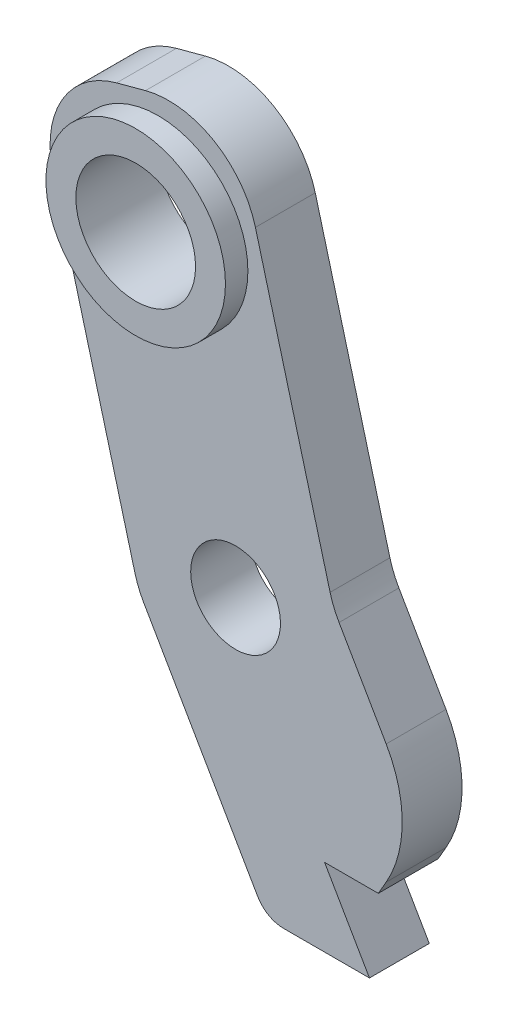
ISO-10303-21;
HEADER;
FILE_DESCRIPTION(('STEP AP214'),'2;1');
FILE_NAME('part.step','',(''),(''),'','','');
FILE_SCHEMA(('AUTOMOTIVE_DESIGN { 1 0 10303 214 1 1 1 1 }'));
ENDSEC;
DATA;
#1=APPLICATION_CONTEXT('core data for automotive mechanical design processes');
#2=APPLICATION_PROTOCOL_DEFINITION('international standard','automotive_design',2000,#1);
#3=PRODUCT_CONTEXT('',#1,'mechanical');
#4=PRODUCT('Part','Part','',(#3));
#5=PRODUCT_RELATED_PRODUCT_CATEGORY('part','',(#4));
#6=PRODUCT_DEFINITION_FORMATION('','',#4);
#7=PRODUCT_DEFINITION_CONTEXT('part definition',#1,'design');
#8=PRODUCT_DEFINITION('design','',#6,#7);
#9=PRODUCT_DEFINITION_SHAPE('','',#8);
#10=(LENGTH_UNIT() NAMED_UNIT(*) SI_UNIT(.MILLI.,.METRE.));
#11=(NAMED_UNIT(*) PLANE_ANGLE_UNIT() SI_UNIT($,.RADIAN.));
#12=(NAMED_UNIT(*) SI_UNIT($,.STERADIAN.) SOLID_ANGLE_UNIT());
#13=UNCERTAINTY_MEASURE_WITH_UNIT(LENGTH_MEASURE(1.E-05),#10,'distance_accuracy_value','');
#14=(GEOMETRIC_REPRESENTATION_CONTEXT(3) GLOBAL_UNCERTAINTY_ASSIGNED_CONTEXT((#13)) GLOBAL_UNIT_ASSIGNED_CONTEXT((#10,
#11,#12)) REPRESENTATION_CONTEXT('',''));
#15=CARTESIAN_POINT('',(0.,0.,0.));
#16=DIRECTION('',(0.,0.,1.));
#17=DIRECTION('',(1.,0.,0.));
#18=AXIS2_PLACEMENT_3D('',#15,#16,#17);
#19=CARTESIAN_POINT('',(0.,0.,37.2524640543525));
#20=DIRECTION('',(0.,0.,1.));
#21=DIRECTION('',(-1.,0.,0.));
#22=AXIS2_PLACEMENT_3D('',#19,#20,#21);
#23=PLANE('',#22);
#24=CARTESIAN_POINT('',(-16.5877555472492,18.6593747845128,37.2524640543525));
#25=DIRECTION('',(0.,0.,-1.));
#26=DIRECTION('',(-1.,0.,0.));
#27=AXIS2_PLACEMENT_3D('',#24,#25,#26);
#28=CIRCLE('',#27,3.00000000000001);
#29=CARTESIAN_POINT('',(-19.5877555472492,18.6593747845128,37.2524640543525));
#30=VERTEX_POINT('',#29);
#31=EDGE_CURVE('E11',#30,#30,#28,.T.);
#32=ORIENTED_EDGE('',*,*,#31,.T.);
#33=EDGE_LOOP('',(#32));
#34=FACE_BOUND('',#33,.T.);
#35=DIRECTION('',(0.999999998986407,-4.50242804108572E-05,0.));
#36=VECTOR('',#35,1.);
#37=CARTESIAN_POINT('',(-12.9759854417635,0.226354757444194,37.2524640543525));
#38=LINE('',#37,#36);
#39=CARTESIAN_POINT('',(-12.3986651889558,0.226328764015219,37.2524640543525));
#40=VERTEX_POINT('',#39);
#41=CARTESIAN_POINT('',(-9.52484687315475,0.226199372413387,37.2524640543525));
#42=VERTEX_POINT('',#41);
#43=EDGE_CURVE('E151',#40,#42,#38,.T.);
#44=ORIENTED_EDGE('',*,*,#43,.T.);
#45=DIRECTION('',(-0.500000000000004,0.866025403784436,0.));
#46=VECTOR('',#45,1.);
#47=CARTESIAN_POINT('',(-9.52484687315475,0.226199372413387,37.2524640543525));
#48=LINE('',#47,#46);
#49=CARTESIAN_POINT('',(-11.0248468731548,2.8242755837667,37.2524640543525));
#50=VERTEX_POINT('',#49);
#51=EDGE_CURVE('E156',#42,#50,#48,.T.);
#52=ORIENTED_EDGE('',*,*,#51,.T.);
#53=DIRECTION('',(1.,0.,0.));
#54=VECTOR('',#53,1.);
#55=CARTESIAN_POINT('',(-11.0248468731548,2.8242755837667,37.2524640543525));
#56=LINE('',#55,#54);
#57=CARTESIAN_POINT('',(-9.2296199535991,2.8242755837667,37.2524640543525));
#58=VERTEX_POINT('',#57);
#59=EDGE_CURVE('E178',#50,#58,#56,.T.);
#60=ORIENTED_EDGE('',*,*,#59,.T.);
#61=DIRECTION('',(0.500000000000004,0.866025403784436,0.));
#62=VECTOR('',#61,1.);
#63=CARTESIAN_POINT('',(-7.81130595755921,5.2808674859938,37.2524640543525));
#64=LINE('',#63,#62);
#65=CARTESIAN_POINT('',(-8.96600649593849,3.28086748599378,37.2524640543525));
#66=VERTEX_POINT('',#65);
#67=EDGE_CURVE('E186',#58,#66,#64,.T.);
#68=ORIENTED_EDGE('',*,*,#67,.T.);
#69=CARTESIAN_POINT('',(-12.4301081110762,5.2808674859938,37.2524640543525));
#70=DIRECTION('',(0.,0.,-1.));
#71=DIRECTION('',(-1.,0.,0.));
#72=AXIS2_PLACEMENT_3D('',#69,#70,#71);
#73=CIRCLE('',#72,4.);
#74=CARTESIAN_POINT('',(-8.96600649593849,7.28086748599382,37.2524640543525));
#75=VERTEX_POINT('',#74);
#76=EDGE_CURVE('E228',#75,#66,#73,.T.);
#77=ORIENTED_EDGE('',*,*,#76,.F.);
#78=DIRECTION('',(-0.500000000000005,0.866025403784436,0.));
#79=VECTOR('',#78,1.);
#80=CARTESIAN_POINT('',(-10.7384791367817,10.3508801549599,37.2524640543525));
#81=LINE('',#80,#79);
#82=CARTESIAN_POINT('',(-10.540966036805,10.0087774306399,37.2524640543525));
#83=VERTEX_POINT('',#82);
#84=EDGE_CURVE('E261',#75,#83,#81,.T.);
#85=ORIENTED_EDGE('',*,*,#84,.T.);
#86=CARTESIAN_POINT('',(-7.94288982545166,11.5087774306399,37.2524640543525));
#87=DIRECTION('',(0.,0.,-1.));
#88=DIRECTION('',(-1.,0.,0.));
#89=AXIS2_PLACEMENT_3D('',#86,#87,#88);
#90=CIRCLE('',#89,3.);
#91=CARTESIAN_POINT('',(-10.8407022608055,10.7324507664651,37.2524640543525));
#92=VERTEX_POINT('',#91);
#93=EDGE_CURVE('E221',#92,#83,#90,.F.);
#94=ORIENTED_EDGE('',*,*,#93,.F.);
#95=DIRECTION('',(-0.258775554724922,0.965937478451276,0.));
#96=VECTOR('',#95,1.);
#97=CARTESIAN_POINT('',(-10.7384791367817,10.3508801549599,37.2524640543525));
#98=LINE('',#97,#96);
#99=CARTESIAN_POINT('',(-13.3363621500322,20.0480579652756,37.2524640543525));
#100=VERTEX_POINT('',#99);
#101=EDGE_CURVE('E257',#92,#100,#98,.T.);
#102=ORIENTED_EDGE('',*,*,#101,.T.);
#103=CARTESIAN_POINT('',(-16.2341745853861,19.2717313011009,37.2524640543525));
#104=DIRECTION('',(0.,0.,-1.));
#105=DIRECTION('',(-1.,0.,0.));
#106=AXIS2_PLACEMENT_3D('',#103,#104,#105);
#107=CIRCLE('',#106,3.);
#108=CARTESIAN_POINT('',(-17.0105012495608,22.1695437364547,37.2524640543525));
#109=VERTEX_POINT('',#108);
#110=EDGE_CURVE('E199',#109,#100,#107,.T.);
#111=ORIENTED_EDGE('',*,*,#110,.F.);
#112=DIRECTION('',(-0.965937478451276,-0.258775554724923,0.));
#113=VECTOR('',#112,1.);
#114=CARTESIAN_POINT('',(-14.112688814207,22.9458704006295,37.2524640543525));
#115=LINE('',#114,#113);
#116=CARTESIAN_POINT('',(-17.9764387280121,21.9107681817298,37.2524640543525));
#117=VERTEX_POINT('',#116);
#118=EDGE_CURVE('E252',#109,#117,#115,.T.);
#119=ORIENTED_EDGE('',*,*,#118,.T.);
#120=CARTESIAN_POINT('',(-17.2001120638373,19.0129557463759,37.2524640543525));
#121=DIRECTION('',(0.,0.,-1.));
#122=DIRECTION('',(-1.,0.,0.));
#123=AXIS2_PLACEMENT_3D('',#120,#121,#122);
#124=CIRCLE('',#123,3.);
#125=CARTESIAN_POINT('',(-20.0979244991912,18.2366290822012,37.2524640543525));
#126=VERTEX_POINT('',#125);
#127=EDGE_CURVE('E196',#126,#117,#124,.T.);
#128=ORIENTED_EDGE('',*,*,#127,.F.);
#129=DIRECTION('',(0.258775554724923,-0.965937478451276,0.));
#130=VECTOR('',#129,1.);
#131=CARTESIAN_POINT('',(-20.8742511633659,21.134441517555,37.2524640543525));
#132=LINE('',#131,#130);
#133=CARTESIAN_POINT('',(-17.3637439872422,8.03069045654523,37.2524640543525));
#134=VERTEX_POINT('',#133);
#135=EDGE_CURVE('E243',#126,#134,#132,.T.);
#136=ORIENTED_EDGE('',*,*,#135,.T.);
#137=CARTESIAN_POINT('',(-14.4659315518883,8.80701712072,37.2524640543525));
#138=DIRECTION('',(0.,0.,-1.));
#139=DIRECTION('',(-1.,0.,0.));
#140=AXIS2_PLACEMENT_3D('',#137,#138,#139);
#141=CIRCLE('',#140,3.);
#142=CARTESIAN_POINT('',(-17.0640077632416,7.30701712071999,37.2524640543525));
#143=VERTEX_POINT('',#142);
#144=EDGE_CURVE('E202',#143,#134,#141,.T.);
#145=ORIENTED_EDGE('',*,*,#144,.F.);
#146=DIRECTION('',(0.500000000000005,-0.866025403784436,0.));
#147=VECTOR('',#146,1.);
#148=CARTESIAN_POINT('',(-17.2615208632183,7.64911984504006,37.2524640543525));
#149=LINE('',#148,#147);
#150=CARTESIAN_POINT('',(-13.2646455684599,0.726328763001622,37.2524640543525));
#151=VERTEX_POINT('',#150);
#152=EDGE_CURVE('E164',#143,#151,#149,.T.);
#153=ORIENTED_EDGE('',*,*,#152,.T.);
#154=CARTESIAN_POINT('',(-12.3986201646754,1.22632876300163,37.2524640543525));
#155=DIRECTION('',(0.,0.,-1.));
#156=DIRECTION('',(-1.,0.,0.));
#157=AXIS2_PLACEMENT_3D('',#154,#155,#156);
#158=CIRCLE('',#157,1.);
#159=EDGE_CURVE('E237',#40,#151,#158,.T.);
#160=ORIENTED_EDGE('',*,*,#159,.F.);
#161=EDGE_LOOP('',(#44,#52,#60,#68,#77,#85,#94,#102,#111,#119,#128,#136,#145,#153,#160));
#162=FACE_BOUND('',#161,.T.);
#163=CARTESIAN_POINT('',(-14.,9.,37.2524640543525));
#164=DIRECTION('',(0.,0.,1.));
#165=DIRECTION('',(0.,-1.,0.));
#166=AXIS2_PLACEMENT_3D('',#163,#164,#165);
#167=CIRCLE('',#166,1.5);
#168=CARTESIAN_POINT('',(-14.,7.5,37.2524640543525));
#169=VERTEX_POINT('',#168);
#170=EDGE_CURVE('E265',#169,#169,#167,.T.);
#171=ORIENTED_EDGE('',*,*,#170,.F.);
#172=EDGE_LOOP('',(#171));
#173=FACE_BOUND('',#172,.T.);
#174=ADVANCED_FACE('F35',(#34,#162,#173),#23,.T.);
#175=CARTESIAN_POINT('',(-10.7384791367817,10.3508801549599,9.04513704299428));
#176=DIRECTION('',(-0.866025403784436,-0.500000000000005,0.));
#177=DIRECTION('',(0.500000000000005,-0.866025403784436,0.));
#178=AXIS2_PLACEMENT_3D('',#175,#176,#177);
#179=PLANE('',#178);
#180=DIRECTION('',(0.500000000000005,-0.866025403784436,0.));
#181=VECTOR('',#180,1.);
#182=CARTESIAN_POINT('',(-10.7384791367817,10.3508801549599,35.2524640543526));
#183=LINE('',#182,#181);
#184=CARTESIAN_POINT('',(-10.540966036805,10.0087774306399,35.2524640543526));
#185=VERTEX_POINT('',#184);
#186=CARTESIAN_POINT('',(-8.96600649593849,7.28086748599382,35.2524640543526));
#187=VERTEX_POINT('',#186);
#188=EDGE_CURVE('E264',#185,#187,#183,.T.);
#189=ORIENTED_EDGE('',*,*,#188,.F.);
#190=DIRECTION('',(0.,0.,1.));
#191=VECTOR('',#190,1.);
#192=CARTESIAN_POINT('',(-10.540966036805,10.0087774306399,35.2524640543526));
#193=LINE('',#192,#191);
#194=EDGE_CURVE('E191',#83,#185,#193,.F.);
#195=ORIENTED_EDGE('',*,*,#194,.F.);
#196=ORIENTED_EDGE('',*,*,#84,.F.);
#197=DIRECTION('',(0.,0.,1.));
#198=VECTOR('',#197,1.);
#199=CARTESIAN_POINT('',(-8.96600649593849,7.28086748599382,9.04513704299428));
#200=LINE('',#199,#198);
#201=EDGE_CURVE('E226',#187,#75,#200,.T.);
#202=ORIENTED_EDGE('',*,*,#201,.F.);
#203=EDGE_LOOP('',(#189,#195,#196,#202));
#204=FACE_BOUND('',#203,.T.);
#205=ADVANCED_FACE('F296',(#204),#179,.F.);
#206=CARTESIAN_POINT('',(-10.7384791367817,10.3508801549599,9.04513704299428));
#207=DIRECTION('',(-0.965937478451276,-0.258775554724922,0.));
#208=DIRECTION('',(0.258775554724922,-0.965937478451276,0.));
#209=AXIS2_PLACEMENT_3D('',#206,#207,#208);
#210=PLANE('',#209);
#211=DIRECTION('',(0.258775554724922,-0.965937478451276,0.));
#212=VECTOR('',#211,1.);
#213=CARTESIAN_POINT('',(-10.7384791367817,10.3508801549599,35.2524640543526));
#214=LINE('',#213,#212);
#215=CARTESIAN_POINT('',(-13.3363621500322,20.0480579652756,35.2524640543526));
#216=VERTEX_POINT('',#215);
#217=CARTESIAN_POINT('',(-10.8407022608055,10.7324507664651,35.2524640543526));
#218=VERTEX_POINT('',#217);
#219=EDGE_CURVE('E260',#216,#218,#214,.T.);
#220=ORIENTED_EDGE('',*,*,#219,.F.);
#221=DIRECTION('',(0.,0.,1.));
#222=VECTOR('',#221,1.);
#223=CARTESIAN_POINT('',(-13.3363621500322,20.0480579652756,9.04513704299428));
#224=LINE('',#223,#222);
#225=EDGE_CURVE('E182',#100,#216,#224,.F.);
#226=ORIENTED_EDGE('',*,*,#225,.F.);
#227=ORIENTED_EDGE('',*,*,#101,.F.);
#228=DIRECTION('',(0.,0.,1.));
#229=VECTOR('',#228,1.);
#230=CARTESIAN_POINT('',(-10.8407022608055,10.7324507664651,37.2524640543525));
#231=LINE('',#230,#229);
#232=EDGE_CURVE('E189',#218,#92,#231,.T.);
#233=ORIENTED_EDGE('',*,*,#232,.F.);
#234=EDGE_LOOP('',(#220,#226,#227,#233));
#235=FACE_BOUND('',#234,.T.);
#236=ADVANCED_FACE('F288',(#235),#210,.F.);
#237=CARTESIAN_POINT('',(-14.112688814207,22.9458704006295,9.04513704299428));
#238=DIRECTION('',(0.258775554724923,-0.965937478451276,0.));
#239=DIRECTION('',(0.965937478451276,0.258775554724923,0.));
#240=AXIS2_PLACEMENT_3D('',#237,#238,#239);
#241=PLANE('',#240);
#242=DIRECTION('',(0.965937478451276,0.258775554724923,0.));
#243=VECTOR('',#242,1.);
#244=CARTESIAN_POINT('',(-14.112688814207,22.9458704006295,35.2524640543526));
#245=LINE('',#244,#243);
#246=CARTESIAN_POINT('',(-17.9764387280121,21.9107681817298,35.2524640543526));
#247=VERTEX_POINT('',#246);
#248=CARTESIAN_POINT('',(-17.0105012495608,22.1695437364547,35.2524640543526));
#249=VERTEX_POINT('',#248);
#250=EDGE_CURVE('E256',#247,#249,#245,.T.);
#251=ORIENTED_EDGE('',*,*,#250,.F.);
#252=DIRECTION('',(0.,0.,1.));
#253=VECTOR('',#252,1.);
#254=CARTESIAN_POINT('',(-17.9764387280121,21.9107681817298,9.04513704299428));
#255=LINE('',#254,#253);
#256=EDGE_CURVE('E216',#117,#247,#255,.F.);
#257=ORIENTED_EDGE('',*,*,#256,.F.);
#258=ORIENTED_EDGE('',*,*,#118,.F.);
#259=DIRECTION('',(0.,0.,1.));
#260=VECTOR('',#259,1.);
#261=CARTESIAN_POINT('',(-17.0105012495608,22.1695437364547,9.04513704299428));
#262=LINE('',#261,#260);
#263=EDGE_CURVE('E219',#249,#109,#262,.T.);
#264=ORIENTED_EDGE('',*,*,#263,.F.);
#265=EDGE_LOOP('',(#251,#257,#258,#264));
#266=FACE_BOUND('',#265,.T.);
#267=ADVANCED_FACE('F279',(#266),#241,.F.);
#268=CARTESIAN_POINT('',(-20.8742511633659,21.134441517555,9.04513704299428));
#269=DIRECTION('',(0.965937478451276,0.258775554724923,0.));
#270=DIRECTION('',(-0.258775554724923,0.965937478451276,0.));
#271=AXIS2_PLACEMENT_3D('',#268,#269,#270);
#272=PLANE('',#271);
#273=ORIENTED_EDGE('',*,*,#135,.F.);
#274=DIRECTION('',(0.,0.,1.));
#275=VECTOR('',#274,1.);
#276=CARTESIAN_POINT('',(-20.0979244991912,18.2366290822012,9.04513704299428));
#277=LINE('',#276,#275);
#278=CARTESIAN_POINT('',(-20.0979244991912,18.2366290822012,35.2524640543526));
#279=VERTEX_POINT('',#278);
#280=EDGE_CURVE('E205',#279,#126,#277,.T.);
#281=ORIENTED_EDGE('',*,*,#280,.F.);
#282=DIRECTION('',(-0.258775554724923,0.965937478451276,0.));
#283=VECTOR('',#282,1.);
#284=CARTESIAN_POINT('',(-20.8742511633659,21.134441517555,35.2524640543526));
#285=LINE('',#284,#283);
#286=CARTESIAN_POINT('',(-17.3637439872422,8.03069045654524,35.2524640543526));
#287=VERTEX_POINT('',#286);
#288=EDGE_CURVE('E245',#287,#279,#285,.T.);
#289=ORIENTED_EDGE('',*,*,#288,.F.);
#290=DIRECTION('',(0.,0.,1.));
#291=VECTOR('',#290,1.);
#292=CARTESIAN_POINT('',(-17.3637439872422,8.03069045654524,9.04513704299428));
#293=LINE('',#292,#291);
#294=EDGE_CURVE('E207',#134,#287,#293,.F.);
#295=ORIENTED_EDGE('',*,*,#294,.F.);
#296=EDGE_LOOP('',(#273,#281,#289,#295));
#297=FACE_BOUND('',#296,.T.);
#298=ADVANCED_FACE('F356',(#297),#272,.F.);
#299=CARTESIAN_POINT('',(-17.2615208632183,7.64911984504006,9.04513704299428));
#300=DIRECTION('',(0.866025403784436,0.500000000000005,0.));
#301=DIRECTION('',(-0.500000000000005,0.866025403784436,0.));
#302=AXIS2_PLACEMENT_3D('',#299,#300,#301);
#303=PLANE('',#302);
#304=ORIENTED_EDGE('',*,*,#152,.F.);
#305=DIRECTION('',(0.,0.,1.));
#306=VECTOR('',#305,1.);
#307=CARTESIAN_POINT('',(-17.0640077632416,7.30701712071999,9.04513704299428));
#308=LINE('',#307,#306);
#309=CARTESIAN_POINT('',(-17.0640077632416,7.30701712071999,35.2524640543526));
#310=VERTEX_POINT('',#309);
#311=EDGE_CURVE('E194',#310,#143,#308,.T.);
#312=ORIENTED_EDGE('',*,*,#311,.F.);
#313=DIRECTION('',(-0.500000000000005,0.866025403784436,0.));
#314=VECTOR('',#313,1.);
#315=CARTESIAN_POINT('',(-17.2615208632183,7.64911984504006,35.2524640543526));
#316=LINE('',#315,#314);
#317=CARTESIAN_POINT('',(-13.2646455684599,0.726328763001622,35.2524640543526));
#318=VERTEX_POINT('',#317);
#319=EDGE_CURVE('E168',#318,#310,#316,.T.);
#320=ORIENTED_EDGE('',*,*,#319,.F.);
#321=DIRECTION('',(0.,0.,1.));
#322=VECTOR('',#321,1.);
#323=CARTESIAN_POINT('',(-13.2646455684599,0.726328763001622,9.04513704299428));
#324=LINE('',#323,#322);
#325=EDGE_CURVE('E56',#151,#318,#324,.F.);
#326=ORIENTED_EDGE('',*,*,#325,.F.);
#327=EDGE_LOOP('',(#304,#312,#320,#326));
#328=FACE_BOUND('',#327,.T.);
#329=ADVANCED_FACE('F242',(#328),#303,.F.);
#330=CARTESIAN_POINT('',(-12.9759854417635,0.226354757444194,9.04513704299428));
#331=DIRECTION('',(4.50242804108572E-05,0.999999998986407,0.));
#332=DIRECTION('',(-0.999999998986407,4.50242804108572E-05,0.));
#333=AXIS2_PLACEMENT_3D('',#330,#331,#332);
#334=PLANE('',#333);
#335=DIRECTION('',(-0.999999998986407,4.50242804108572E-05,0.));
#336=VECTOR('',#335,1.);
#337=CARTESIAN_POINT('',(-12.9759854417635,0.226354757444194,35.2524640543526));
#338=LINE('',#337,#336);
#339=CARTESIAN_POINT('',(-9.52484687315475,0.226199372413387,35.2524640543526));
#340=VERTEX_POINT('',#339);
#341=CARTESIAN_POINT('',(-12.3986651889558,0.226328764015219,35.2524640543526));
#342=VERTEX_POINT('',#341);
#343=EDGE_CURVE('E145',#340,#342,#338,.T.);
#344=ORIENTED_EDGE('',*,*,#343,.F.);
#345=DIRECTION('',(0.,0.,1.));
#346=VECTOR('',#345,1.);
#347=CARTESIAN_POINT('',(-9.52484687315475,0.226199372413387,9.04513704299428));
#348=LINE('',#347,#346);
#349=EDGE_CURVE('E150',#340,#42,#348,.T.);
#350=ORIENTED_EDGE('',*,*,#349,.T.);
#351=ORIENTED_EDGE('',*,*,#43,.F.);
#352=DIRECTION('',(0.,0.,1.));
#353=VECTOR('',#352,1.);
#354=CARTESIAN_POINT('',(-12.3986651889558,0.226328764015219,9.04513704299428));
#355=LINE('',#354,#353);
#356=EDGE_CURVE('E163',#342,#40,#355,.T.);
#357=ORIENTED_EDGE('',*,*,#356,.F.);
#358=EDGE_LOOP('',(#344,#350,#351,#357));
#359=FACE_BOUND('',#358,.T.);
#360=ADVANCED_FACE('F162',(#359),#334,.F.);
#361=CARTESIAN_POINT('',(-9.52484687315475,0.226199372413387,9.04513704299428));
#362=DIRECTION('',(-0.866025403784436,-0.500000000000004,0.));
#363=DIRECTION('',(0.500000000000004,-0.866025403784436,0.));
#364=AXIS2_PLACEMENT_3D('',#361,#362,#363);
#365=PLANE('',#364);
#366=DIRECTION('',(0.,0.,1.));
#367=VECTOR('',#366,1.);
#368=CARTESIAN_POINT('',(-11.0248468731548,2.8242755837667,9.04513704299428));
#369=LINE('',#368,#367);
#370=CARTESIAN_POINT('',(-11.0248468731548,2.8242755837667,35.2524640543526));
#371=VERTEX_POINT('',#370);
#372=EDGE_CURVE('E174',#371,#50,#369,.T.);
#373=ORIENTED_EDGE('',*,*,#372,.T.);
#374=ORIENTED_EDGE('',*,*,#51,.F.);
#375=ORIENTED_EDGE('',*,*,#349,.F.);
#376=DIRECTION('',(0.500000000000004,-0.866025403784436,0.));
#377=VECTOR('',#376,1.);
#378=CARTESIAN_POINT('',(-9.52484687315475,0.226199372413387,35.2524640543526));
#379=LINE('',#378,#377);
#380=EDGE_CURVE('E141',#371,#340,#379,.T.);
#381=ORIENTED_EDGE('',*,*,#380,.F.);
#382=EDGE_LOOP('',(#373,#374,#375,#381));
#383=FACE_BOUND('',#382,.T.);
#384=ADVANCED_FACE('F154',(#383),#365,.F.);
#385=CARTESIAN_POINT('',(-11.0248468731548,2.8242755837667,9.04513704299428));
#386=DIRECTION('',(0.,1.,0.));
#387=DIRECTION('',(0.,0.,-1.));
#388=AXIS2_PLACEMENT_3D('',#385,#386,#387);
#389=PLANE('',#388);
#390=DIRECTION('',(0.,0.,1.));
#391=VECTOR('',#390,1.);
#392=CARTESIAN_POINT('',(-9.2296199535991,2.8242755837667,9.04513704299428));
#393=LINE('',#392,#391);
#394=CARTESIAN_POINT('',(-9.2296199535991,2.8242755837667,35.2524640543526));
#395=VERTEX_POINT('',#394);
#396=EDGE_CURVE('E177',#395,#58,#393,.T.);
#397=ORIENTED_EDGE('',*,*,#396,.T.);
#398=ORIENTED_EDGE('',*,*,#59,.F.);
#399=ORIENTED_EDGE('',*,*,#372,.F.);
#400=DIRECTION('',(-1.,0.,0.));
#401=VECTOR('',#400,1.);
#402=CARTESIAN_POINT('',(-11.0248468731548,2.8242755837667,35.2524640543526));
#403=LINE('',#402,#401);
#404=EDGE_CURVE('E147',#395,#371,#403,.T.);
#405=ORIENTED_EDGE('',*,*,#404,.F.);
#406=EDGE_LOOP('',(#397,#398,#399,#405));
#407=FACE_BOUND('',#406,.T.);
#408=ADVANCED_FACE('F305',(#407),#389,.F.);
#409=CARTESIAN_POINT('',(-7.81130595755921,5.2808674859938,9.04513704299428));
#410=DIRECTION('',(-0.866025403784436,0.500000000000004,0.));
#411=DIRECTION('',(-0.500000000000004,-0.866025403784436,0.));
#412=AXIS2_PLACEMENT_3D('',#409,#410,#411);
#413=PLANE('',#412);
#414=ORIENTED_EDGE('',*,*,#67,.F.);
#415=ORIENTED_EDGE('',*,*,#396,.F.);
#416=DIRECTION('',(-0.500000000000004,-0.866025403784436,0.));
#417=VECTOR('',#416,1.);
#418=CARTESIAN_POINT('',(-7.81130595755921,5.2808674859938,35.2524640543526));
#419=LINE('',#418,#417);
#420=CARTESIAN_POINT('',(-8.96600649593849,3.28086748599378,35.2524640543526));
#421=VERTEX_POINT('',#420);
#422=EDGE_CURVE('E175',#421,#395,#419,.T.);
#423=ORIENTED_EDGE('',*,*,#422,.F.);
#424=DIRECTION('',(0.,0.,1.));
#425=VECTOR('',#424,1.);
#426=CARTESIAN_POINT('',(-8.96600649593849,3.28086748599378,9.04513704299428));
#427=LINE('',#426,#425);
#428=EDGE_CURVE('E231',#66,#421,#427,.F.);
#429=ORIENTED_EDGE('',*,*,#428,.F.);
#430=EDGE_LOOP('',(#414,#415,#423,#429));
#431=FACE_BOUND('',#430,.T.);
#432=ADVANCED_FACE('F308',(#431),#413,.F.);
#433=CARTESIAN_POINT('',(-16.5877555472492,18.6593747845128,9.04513704299428));
#434=DIRECTION('',(0.,0.,1.));
#435=DIRECTION('',(0.,1.,0.));
#436=AXIS2_PLACEMENT_3D('',#433,#434,#435);
#437=CYLINDRICAL_SURFACE('',#436,2.);
#438=CARTESIAN_POINT('',(-16.5877555472492,18.6593747845128,35.2524640543526));
#439=DIRECTION('',(0.,0.,-1.));
#440=DIRECTION('',(-1.,0.,0.));
#441=AXIS2_PLACEMENT_3D('',#438,#439,#440);
#442=CIRCLE('',#441,2.);
#443=CARTESIAN_POINT('',(-18.5877555472492,18.6593747845128,35.2524640543526));
#444=VERTEX_POINT('',#443);
#445=EDGE_CURVE('E179',#444,#444,#442,.T.);
#446=ORIENTED_EDGE('',*,*,#445,.T.);
#447=EDGE_LOOP('',(#446));
#448=FACE_BOUND('',#447,.T.);
#449=CARTESIAN_POINT('',(-16.5877555472492,18.6593747845128,38.0024640543525));
#450=DIRECTION('',(0.,0.,1.));
#451=DIRECTION('',(1.,0.,0.));
#452=AXIS2_PLACEMENT_3D('',#449,#450,#451);
#453=CIRCLE('',#452,2.);
#454=CARTESIAN_POINT('',(-14.5877555472492,18.6593747845128,38.0024640543525));
#455=VERTEX_POINT('',#454);
#456=EDGE_CURVE('E317',#455,#455,#453,.T.);
#457=ORIENTED_EDGE('',*,*,#456,.T.);
#458=EDGE_LOOP('',(#457));
#459=FACE_BOUND('',#458,.T.);
#460=ADVANCED_FACE('F321',(#448,#459),#437,.F.);
#461=CARTESIAN_POINT('',(-14.,9.,9.04513704299428));
#462=DIRECTION('',(0.,0.,1.));
#463=DIRECTION('',(0.,1.,0.));
#464=AXIS2_PLACEMENT_3D('',#461,#462,#463);
#465=CYLINDRICAL_SURFACE('',#464,1.5);
#466=CARTESIAN_POINT('',(-14.,9.,35.2524640543526));
#467=DIRECTION('',(0.,0.,-1.));
#468=DIRECTION('',(-1.,0.,0.));
#469=AXIS2_PLACEMENT_3D('',#466,#467,#468);
#470=CIRCLE('',#469,1.5);
#471=CARTESIAN_POINT('',(-15.5,9.,35.2524640543526));
#472=VERTEX_POINT('',#471);
#473=EDGE_CURVE('E183',#472,#472,#470,.T.);
#474=ORIENTED_EDGE('',*,*,#473,.T.);
#475=EDGE_LOOP('',(#474));
#476=FACE_BOUND('',#475,.T.);
#477=ORIENTED_EDGE('',*,*,#170,.T.);
#478=EDGE_LOOP('',(#477));
#479=FACE_BOUND('',#478,.T.);
#480=ADVANCED_FACE('F344',(#476,#479),#465,.F.);
#481=CARTESIAN_POINT('',(0.,0.,35.2524640543526));
#482=DIRECTION('',(0.,0.,1.));
#483=DIRECTION('',(-1.,0.,0.));
#484=AXIS2_PLACEMENT_3D('',#481,#482,#483);
#485=PLANE('',#484);
#486=ORIENTED_EDGE('',*,*,#473,.F.);
#487=EDGE_LOOP('',(#486));
#488=FACE_BOUND('',#487,.T.);
#489=ORIENTED_EDGE('',*,*,#445,.F.);
#490=EDGE_LOOP('',(#489));
#491=FACE_BOUND('',#490,.T.);
#492=ORIENTED_EDGE('',*,*,#319,.T.);
#493=CARTESIAN_POINT('',(-14.4659315518883,8.80701712072,35.2524640543526));
#494=DIRECTION('',(0.,0.,-1.));
#495=DIRECTION('',(-1.,0.,0.));
#496=AXIS2_PLACEMENT_3D('',#493,#494,#495);
#497=CIRCLE('',#496,3.);
#498=EDGE_CURVE('E214',#287,#310,#497,.F.);
#499=ORIENTED_EDGE('',*,*,#498,.F.);
#500=ORIENTED_EDGE('',*,*,#288,.T.);
#501=CARTESIAN_POINT('',(-17.2001120638373,19.0129557463759,35.2524640543526));
#502=DIRECTION('',(0.,0.,-1.));
#503=DIRECTION('',(-1.,0.,0.));
#504=AXIS2_PLACEMENT_3D('',#501,#502,#503);
#505=CIRCLE('',#504,3.);
#506=EDGE_CURVE('E210',#247,#279,#505,.F.);
#507=ORIENTED_EDGE('',*,*,#506,.F.);
#508=ORIENTED_EDGE('',*,*,#250,.T.);
#509=CARTESIAN_POINT('',(-16.2341745853861,19.2717313011009,35.2524640543526));
#510=DIRECTION('',(0.,0.,-1.));
#511=DIRECTION('',(-1.,0.,0.));
#512=AXIS2_PLACEMENT_3D('',#509,#510,#511);
#513=CIRCLE('',#512,3.);
#514=EDGE_CURVE('E212',#216,#249,#513,.F.);
#515=ORIENTED_EDGE('',*,*,#514,.F.);
#516=ORIENTED_EDGE('',*,*,#219,.T.);
#517=CARTESIAN_POINT('',(-7.94288982545166,11.5087774306399,35.2524640543526));
#518=DIRECTION('',(0.,0.,-1.));
#519=DIRECTION('',(-1.,0.,0.));
#520=AXIS2_PLACEMENT_3D('',#517,#518,#519);
#521=CIRCLE('',#520,3.);
#522=EDGE_CURVE('E224',#185,#218,#521,.T.);
#523=ORIENTED_EDGE('',*,*,#522,.F.);
#524=ORIENTED_EDGE('',*,*,#188,.T.);
#525=CARTESIAN_POINT('',(-12.4301081110762,5.2808674859938,35.2524640543526));
#526=DIRECTION('',(0.,0.,-1.));
#527=DIRECTION('',(-1.,0.,0.));
#528=AXIS2_PLACEMENT_3D('',#525,#526,#527);
#529=CIRCLE('',#528,4.);
#530=EDGE_CURVE('E234',#421,#187,#529,.F.);
#531=ORIENTED_EDGE('',*,*,#530,.F.);
#532=ORIENTED_EDGE('',*,*,#422,.T.);
#533=ORIENTED_EDGE('',*,*,#404,.T.);
#534=ORIENTED_EDGE('',*,*,#380,.T.);
#535=ORIENTED_EDGE('',*,*,#343,.T.);
#536=CARTESIAN_POINT('',(-12.3986201646754,1.22632876300163,35.2524640543526));
#537=DIRECTION('',(0.,0.,-1.));
#538=DIRECTION('',(-1.,0.,0.));
#539=AXIS2_PLACEMENT_3D('',#536,#537,#538);
#540=CIRCLE('',#539,1.);
#541=EDGE_CURVE('E43',#318,#342,#540,.F.);
#542=ORIENTED_EDGE('',*,*,#541,.F.);
#543=EDGE_LOOP('',(#492,#499,#500,#507,#508,#515,#516,#523,#524,#531,#532,#533,#534,#535,#542));
#544=FACE_BOUND('',#543,.T.);
#545=ADVANCED_FACE('F143',(#488,#491,#544),#485,.F.);
#546=CARTESIAN_POINT('',(-7.94288982545166,11.5087774306399,9.04513704299428));
#547=DIRECTION('',(0.,0.,-1.));
#548=DIRECTION('',(0.,-1.,0.));
#549=AXIS2_PLACEMENT_3D('',#546,#547,#548);
#550=CYLINDRICAL_SURFACE('',#549,3.);
#551=ORIENTED_EDGE('',*,*,#522,.T.);
#552=ORIENTED_EDGE('',*,*,#232,.T.);
#553=ORIENTED_EDGE('',*,*,#93,.T.);
#554=ORIENTED_EDGE('',*,*,#194,.T.);
#555=EDGE_LOOP('',(#551,#552,#553,#554));
#556=FACE_BOUND('',#555,.T.);
#557=ADVANCED_FACE('F291',(#556),#550,.F.);
#558=CARTESIAN_POINT('',(-14.4659315518883,8.80701712072,9.04513704299428));
#559=DIRECTION('',(0.,0.,1.));
#560=DIRECTION('',(0.,1.,0.));
#561=AXIS2_PLACEMENT_3D('',#558,#559,#560);
#562=CYLINDRICAL_SURFACE('',#561,3.);
#563=ORIENTED_EDGE('',*,*,#498,.T.);
#564=ORIENTED_EDGE('',*,*,#311,.T.);
#565=ORIENTED_EDGE('',*,*,#144,.T.);
#566=ORIENTED_EDGE('',*,*,#294,.T.);
#567=EDGE_LOOP('',(#563,#564,#565,#566));
#568=FACE_BOUND('',#567,.T.);
#569=ADVANCED_FACE('F372',(#568),#562,.T.);
#570=CARTESIAN_POINT('',(-16.2341745853861,19.2717313011009,9.04513704299428));
#571=DIRECTION('',(0.,0.,1.));
#572=DIRECTION('',(0.,1.,0.));
#573=AXIS2_PLACEMENT_3D('',#570,#571,#572);
#574=CYLINDRICAL_SURFACE('',#573,3.);
#575=ORIENTED_EDGE('',*,*,#514,.T.);
#576=ORIENTED_EDGE('',*,*,#263,.T.);
#577=ORIENTED_EDGE('',*,*,#110,.T.);
#578=ORIENTED_EDGE('',*,*,#225,.T.);
#579=EDGE_LOOP('',(#575,#576,#577,#578));
#580=FACE_BOUND('',#579,.T.);
#581=ADVANCED_FACE('F283',(#580),#574,.T.);
#582=CARTESIAN_POINT('',(-17.2001120638373,19.0129557463759,9.04513704299428));
#583=DIRECTION('',(0.,0.,1.));
#584=DIRECTION('',(0.,1.,0.));
#585=AXIS2_PLACEMENT_3D('',#582,#583,#584);
#586=CYLINDRICAL_SURFACE('',#585,3.);
#587=ORIENTED_EDGE('',*,*,#506,.T.);
#588=ORIENTED_EDGE('',*,*,#280,.T.);
#589=ORIENTED_EDGE('',*,*,#127,.T.);
#590=ORIENTED_EDGE('',*,*,#256,.T.);
#591=EDGE_LOOP('',(#587,#588,#589,#590));
#592=FACE_BOUND('',#591,.T.);
#593=ADVANCED_FACE('F378',(#592),#586,.T.);
#594=CARTESIAN_POINT('',(-12.4301081110762,5.2808674859938,9.04513704299428));
#595=DIRECTION('',(0.,0.,1.));
#596=DIRECTION('',(0.,1.,0.));
#597=AXIS2_PLACEMENT_3D('',#594,#595,#596);
#598=CYLINDRICAL_SURFACE('',#597,4.);
#599=ORIENTED_EDGE('',*,*,#530,.T.);
#600=ORIENTED_EDGE('',*,*,#201,.T.);
#601=ORIENTED_EDGE('',*,*,#76,.T.);
#602=ORIENTED_EDGE('',*,*,#428,.T.);
#603=EDGE_LOOP('',(#599,#600,#601,#602));
#604=FACE_BOUND('',#603,.T.);
#605=ADVANCED_FACE('F299',(#604),#598,.T.);
#606=CARTESIAN_POINT('',(-12.3986201646754,1.22632876300163,9.04513704299428));
#607=DIRECTION('',(0.,0.,1.));
#608=DIRECTION('',(0.,1.,0.));
#609=AXIS2_PLACEMENT_3D('',#606,#607,#608);
#610=CYLINDRICAL_SURFACE('',#609,1.);
#611=ORIENTED_EDGE('',*,*,#541,.T.);
#612=ORIENTED_EDGE('',*,*,#356,.T.);
#613=ORIENTED_EDGE('',*,*,#159,.T.);
#614=ORIENTED_EDGE('',*,*,#325,.T.);
#615=EDGE_LOOP('',(#611,#612,#613,#614));
#616=FACE_BOUND('',#615,.T.);
#617=ADVANCED_FACE('F37',(#616),#610,.T.);
#618=CARTESIAN_POINT('',(-16.5877555472492,18.6593747845128,38.0024640543525));
#619=DIRECTION('',(0.,0.,-1.));
#620=DIRECTION('',(1.,0.,0.));
#621=AXIS2_PLACEMENT_3D('',#618,#619,#620);
#622=CYLINDRICAL_SURFACE('',#621,3.00000000000001);
#623=CARTESIAN_POINT('',(-16.5877555472492,18.6593747845128,38.0024640543525));
#624=DIRECTION('',(0.,0.,1.));
#625=DIRECTION('',(1.,0.,0.));
#626=AXIS2_PLACEMENT_3D('',#623,#624,#625);
#627=CIRCLE('',#626,3.00000000000001);
#628=CARTESIAN_POINT('',(-13.5877555472492,18.6593747845128,38.0024640543525));
#629=VERTEX_POINT('',#628);
#630=EDGE_CURVE('E267',#629,#629,#627,.T.);
#631=ORIENTED_EDGE('',*,*,#630,.F.);
#632=EDGE_LOOP('',(#631));
#633=FACE_BOUND('',#632,.T.);
#634=ORIENTED_EDGE('',*,*,#31,.F.);
#635=EDGE_LOOP('',(#634));
#636=FACE_BOUND('',#635,.T.);
#637=ADVANCED_FACE('F326',(#633,#636),#622,.T.);
#638=CARTESIAN_POINT('',(-16.5877555472492,18.6593747845128,38.0024640543525));
#639=DIRECTION('',(0.,0.,-1.));
#640=DIRECTION('',(1.,0.,0.));
#641=AXIS2_PLACEMENT_3D('',#638,#639,#640);
#642=PLANE('',#641);
#643=ORIENTED_EDGE('',*,*,#456,.F.);
#644=EDGE_LOOP('',(#643));
#645=FACE_BOUND('',#644,.T.);
#646=ORIENTED_EDGE('',*,*,#630,.T.);
#647=EDGE_LOOP('',(#646));
#648=FACE_BOUND('',#647,.T.);
#649=ADVANCED_FACE('F323',(#645,#648),#642,.F.);
#650=CLOSED_SHELL('',(#174,#205,#236,#267,#298,#329,#360,#384,#408,#432,#460,#480,#545,#557,
#569,#581,#593,#605,#617,#637,#649));
#651=MANIFOLD_SOLID_BREP('B2',#650);
#652=ADVANCED_BREP_SHAPE_REPRESENTATION('',(#18,#651),#14);
#653=SHAPE_DEFINITION_REPRESENTATION(#9,#652);
ENDSEC;
END-ISO-10303-21;
